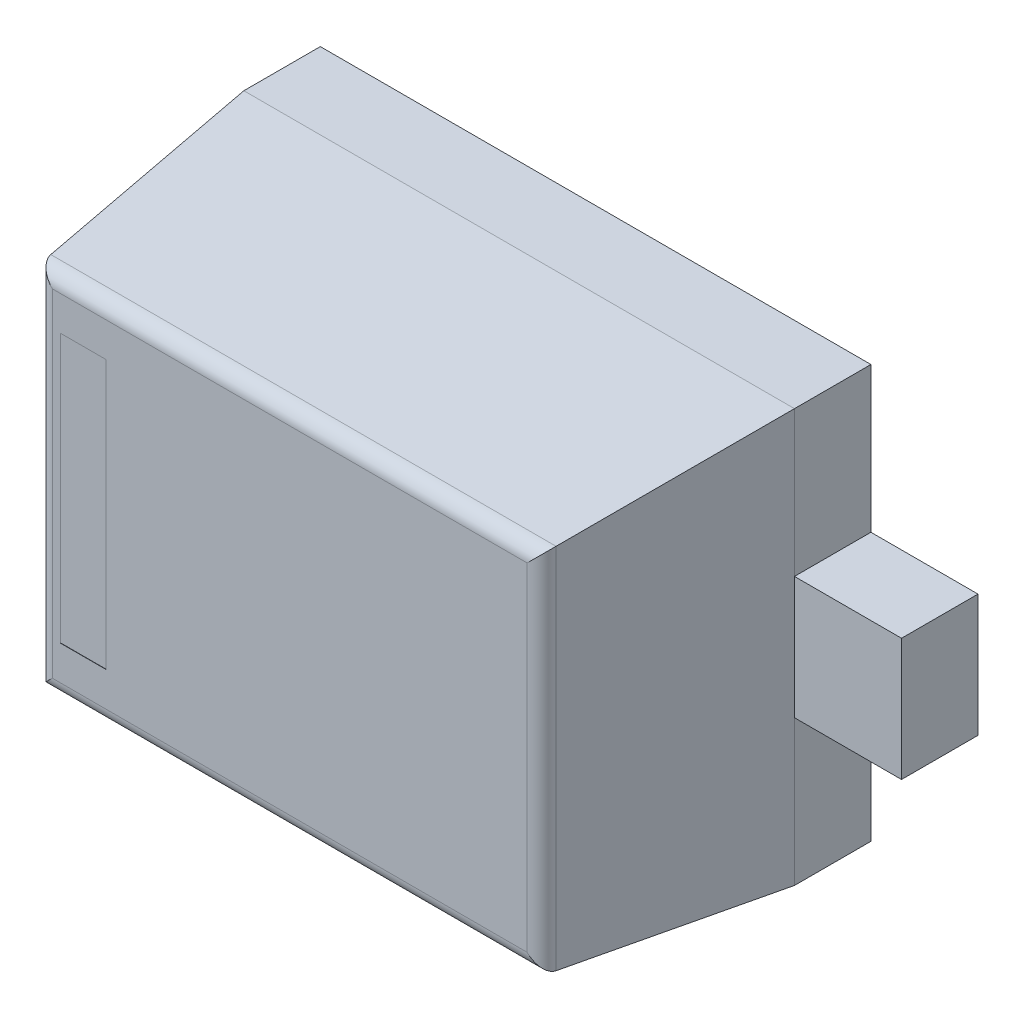
ISO-10303-21;
HEADER;
FILE_DESCRIPTION(('STEP AP214'),'2;1');
FILE_NAME('part.step','',(''),(''),'','','');
FILE_SCHEMA(('AUTOMOTIVE_DESIGN { 1 0 10303 214 1 1 1 1 }'));
ENDSEC;
DATA;
#1=APPLICATION_CONTEXT('core data for automotive mechanical design processes');
#2=APPLICATION_PROTOCOL_DEFINITION('international standard','automotive_design',2000,#1);
#3=PRODUCT_CONTEXT('',#1,'mechanical');
#4=PRODUCT('Part','Part','',(#3));
#5=PRODUCT_RELATED_PRODUCT_CATEGORY('part','',(#4));
#6=PRODUCT_DEFINITION_FORMATION('','',#4);
#7=PRODUCT_DEFINITION_CONTEXT('part definition',#1,'design');
#8=PRODUCT_DEFINITION('design','',#6,#7);
#9=PRODUCT_DEFINITION_SHAPE('','',#8);
#10=(LENGTH_UNIT() NAMED_UNIT(*) SI_UNIT(.MILLI.,.METRE.));
#11=(NAMED_UNIT(*) PLANE_ANGLE_UNIT() SI_UNIT($,.RADIAN.));
#12=(NAMED_UNIT(*) SI_UNIT($,.STERADIAN.) SOLID_ANGLE_UNIT());
#13=UNCERTAINTY_MEASURE_WITH_UNIT(LENGTH_MEASURE(1.E-05),#10,'distance_accuracy_value','');
#14=(GEOMETRIC_REPRESENTATION_CONTEXT(3) GLOBAL_UNCERTAINTY_ASSIGNED_CONTEXT((#13)) GLOBAL_UNIT_ASSIGNED_CONTEXT((#10,
#11,#12)) REPRESENTATION_CONTEXT('',''));
#15=CARTESIAN_POINT('',(0.,0.,0.));
#16=DIRECTION('',(0.,0.,1.));
#17=DIRECTION('',(1.,0.,0.));
#18=AXIS2_PLACEMENT_3D('',#15,#16,#17);
#19=CARTESIAN_POINT('',(-0.9,0.675,1.));
#20=DIRECTION('',(1.,0.,0.));
#21=DIRECTION('',(0.,1.,0.));
#22=AXIS2_PLACEMENT_3D('',#19,#20,#21);
#23=PLANE('',#22);
#24=DIRECTION('',(0.,0.,-1.));
#25=VECTOR('',#24,1.);
#26=CARTESIAN_POINT('',(-0.9,0.2,0.25));
#27=LINE('',#26,#25);
#28=CARTESIAN_POINT('',(-0.9,0.2,0.25));
#29=VERTEX_POINT('',#28);
#30=CARTESIAN_POINT('',(-0.9,0.2,0.));
#31=VERTEX_POINT('',#30);
#32=EDGE_CURVE('E197',#29,#31,#27,.T.);
#33=ORIENTED_EDGE('',*,*,#32,.F.);
#34=DIRECTION('',(0.,1.,0.));
#35=VECTOR('',#34,1.);
#36=CARTESIAN_POINT('',(-0.9,0.675,0.249999999999975));
#37=LINE('',#36,#35);
#38=CARTESIAN_POINT('',(-0.9,0.675,0.249999999999975));
#39=VERTEX_POINT('',#38);
#40=EDGE_CURVE('E235',#29,#39,#37,.T.);
#41=ORIENTED_EDGE('',*,*,#40,.T.);
#42=DIRECTION('',(0.,0.,-1.));
#43=VECTOR('',#42,1.);
#44=CARTESIAN_POINT('',(-0.9,0.675,1.));
#45=LINE('',#44,#43);
#46=CARTESIAN_POINT('',(-0.9,0.675,0.));
#47=VERTEX_POINT('',#46);
#48=EDGE_CURVE('E375',#39,#47,#45,.T.);
#49=ORIENTED_EDGE('',*,*,#48,.T.);
#50=DIRECTION('',(0.,-1.,0.));
#51=VECTOR('',#50,1.);
#52=CARTESIAN_POINT('',(-0.9,0.675,0.));
#53=LINE('',#52,#51);
#54=EDGE_CURVE('E385',#47,#31,#53,.T.);
#55=ORIENTED_EDGE('',*,*,#54,.T.);
#56=EDGE_LOOP('',(#33,#41,#49,#55));
#57=FACE_BOUND('',#56,.T.);
#58=ADVANCED_FACE('F32',(#57),#23,.F.);
#59=CARTESIAN_POINT('',(0.9,0.675,1.));
#60=DIRECTION('',(-1.,0.,0.));
#61=DIRECTION('',(0.,-1.,0.));
#62=AXIS2_PLACEMENT_3D('',#59,#60,#61);
#63=PLANE('',#62);
#64=DIRECTION('',(0.,0.,-1.));
#65=VECTOR('',#64,1.);
#66=CARTESIAN_POINT('',(0.9,-0.2,0.25));
#67=LINE('',#66,#65);
#68=CARTESIAN_POINT('',(0.9,-0.2,0.25));
#69=VERTEX_POINT('',#68);
#70=CARTESIAN_POINT('',(0.9,-0.2,0.));
#71=VERTEX_POINT('',#70);
#72=EDGE_CURVE('E211',#69,#71,#67,.T.);
#73=ORIENTED_EDGE('',*,*,#72,.F.);
#74=DIRECTION('',(0.,-1.,0.));
#75=VECTOR('',#74,1.);
#76=CARTESIAN_POINT('',(0.9,-0.675,0.249999999999975));
#77=LINE('',#76,#75);
#78=CARTESIAN_POINT('',(0.9,-0.675,0.249999999999975));
#79=VERTEX_POINT('',#78);
#80=EDGE_CURVE('E244',#69,#79,#77,.T.);
#81=ORIENTED_EDGE('',*,*,#80,.T.);
#82=DIRECTION('',(0.,0.,-1.));
#83=VECTOR('',#82,1.);
#84=CARTESIAN_POINT('',(0.9,-0.675,1.));
#85=LINE('',#84,#83);
#86=CARTESIAN_POINT('',(0.9,-0.675,0.));
#87=VERTEX_POINT('',#86);
#88=EDGE_CURVE('E372',#79,#87,#85,.T.);
#89=ORIENTED_EDGE('',*,*,#88,.T.);
#90=DIRECTION('',(0.,1.,0.));
#91=VECTOR('',#90,1.);
#92=CARTESIAN_POINT('',(0.9,0.675,0.));
#93=LINE('',#92,#91);
#94=EDGE_CURVE('E395',#87,#71,#93,.T.);
#95=ORIENTED_EDGE('',*,*,#94,.T.);
#96=EDGE_LOOP('',(#73,#81,#89,#95));
#97=FACE_BOUND('',#96,.T.);
#98=ADVANCED_FACE('F342',(#97),#63,.F.);
#99=CARTESIAN_POINT('',(0.9,0.675,0.249999999999975));
#100=VERTEX_POINT('',#99);
#101=CARTESIAN_POINT('',(0.9,0.2,0.25));
#102=VERTEX_POINT('',#101);
#103=EDGE_CURVE('E253',#100,#102,#77,.T.);
#104=ORIENTED_EDGE('',*,*,#103,.T.);
#105=DIRECTION('',(0.,0.,-1.));
#106=VECTOR('',#105,1.);
#107=CARTESIAN_POINT('',(0.9,0.2,0.25));
#108=LINE('',#107,#106);
#109=CARTESIAN_POINT('',(0.9,0.2,0.));
#110=VERTEX_POINT('',#109);
#111=EDGE_CURVE('E220',#102,#110,#108,.T.);
#112=ORIENTED_EDGE('',*,*,#111,.T.);
#113=CARTESIAN_POINT('',(0.9,0.675,0.));
#114=VERTEX_POINT('',#113);
#115=EDGE_CURVE('E285',#110,#114,#93,.T.);
#116=ORIENTED_EDGE('',*,*,#115,.T.);
#117=DIRECTION('',(0.,0.,-1.));
#118=VECTOR('',#117,1.);
#119=CARTESIAN_POINT('',(0.9,0.675,1.));
#120=LINE('',#119,#118);
#121=EDGE_CURVE('E373',#100,#114,#120,.T.);
#122=ORIENTED_EDGE('',*,*,#121,.F.);
#123=EDGE_LOOP('',(#104,#112,#116,#122));
#124=FACE_BOUND('',#123,.T.);
#125=ADVANCED_FACE('F349',(#124),#63,.F.);
#126=CARTESIAN_POINT('',(-0.9,0.675,1.));
#127=DIRECTION('',(0.,-1.,0.));
#128=DIRECTION('',(0.,0.,-1.));
#129=AXIS2_PLACEMENT_3D('',#126,#127,#128);
#130=PLANE('',#129);
#131=ORIENTED_EDGE('',*,*,#48,.F.);
#132=DIRECTION('',(1.,0.,0.));
#133=VECTOR('',#132,1.);
#134=CARTESIAN_POINT('',(0.9,0.675,0.249999999999975));
#135=LINE('',#134,#133);
#136=EDGE_CURVE('E234',#39,#100,#135,.T.);
#137=ORIENTED_EDGE('',*,*,#136,.T.);
#138=ORIENTED_EDGE('',*,*,#121,.T.);
#139=DIRECTION('',(-1.,0.,0.));
#140=VECTOR('',#139,1.);
#141=CARTESIAN_POINT('',(-0.9,0.675,0.));
#142=LINE('',#141,#140);
#143=EDGE_CURVE('E388',#114,#47,#142,.T.);
#144=ORIENTED_EDGE('',*,*,#143,.T.);
#145=EDGE_LOOP('',(#131,#137,#138,#144));
#146=FACE_BOUND('',#145,.T.);
#147=ADVANCED_FACE('F357',(#146),#130,.F.);
#148=CARTESIAN_POINT('',(-0.9,-0.675,0.249999999999975));
#149=VERTEX_POINT('',#148);
#150=CARTESIAN_POINT('',(-0.9,-0.2,0.25));
#151=VERTEX_POINT('',#150);
#152=EDGE_CURVE('E230',#149,#151,#37,.T.);
#153=ORIENTED_EDGE('',*,*,#152,.T.);
#154=DIRECTION('',(0.,0.,-1.));
#155=VECTOR('',#154,1.);
#156=CARTESIAN_POINT('',(-0.9,-0.2,0.25));
#157=LINE('',#156,#155);
#158=CARTESIAN_POINT('',(-0.9,-0.2,0.));
#159=VERTEX_POINT('',#158);
#160=EDGE_CURVE('E175',#151,#159,#157,.T.);
#161=ORIENTED_EDGE('',*,*,#160,.T.);
#162=CARTESIAN_POINT('',(-0.9,-0.675,0.));
#163=VERTEX_POINT('',#162);
#164=EDGE_CURVE('E392',#159,#163,#53,.T.);
#165=ORIENTED_EDGE('',*,*,#164,.T.);
#166=DIRECTION('',(0.,0.,-1.));
#167=VECTOR('',#166,1.);
#168=CARTESIAN_POINT('',(-0.9,-0.675,1.));
#169=LINE('',#168,#167);
#170=EDGE_CURVE('E368',#149,#163,#169,.T.);
#171=ORIENTED_EDGE('',*,*,#170,.F.);
#172=EDGE_LOOP('',(#153,#161,#165,#171));
#173=FACE_BOUND('',#172,.T.);
#174=ADVANCED_FACE('F345',(#173),#23,.F.);
#175=CARTESIAN_POINT('',(-0.9,-0.675,1.));
#176=DIRECTION('',(0.,1.,0.));
#177=DIRECTION('',(0.,0.,1.));
#178=AXIS2_PLACEMENT_3D('',#175,#176,#177);
#179=PLANE('',#178);
#180=ORIENTED_EDGE('',*,*,#88,.F.);
#181=DIRECTION('',(-1.,0.,0.));
#182=VECTOR('',#181,1.);
#183=CARTESIAN_POINT('',(-0.9,-0.675,0.249999999999975));
#184=LINE('',#183,#182);
#185=EDGE_CURVE('E240',#79,#149,#184,.T.);
#186=ORIENTED_EDGE('',*,*,#185,.T.);
#187=ORIENTED_EDGE('',*,*,#170,.T.);
#188=DIRECTION('',(1.,0.,0.));
#189=VECTOR('',#188,1.);
#190=CARTESIAN_POINT('',(-0.9,-0.675,0.));
#191=LINE('',#190,#189);
#192=EDGE_CURVE('E383',#163,#87,#191,.T.);
#193=ORIENTED_EDGE('',*,*,#192,.T.);
#194=EDGE_LOOP('',(#180,#186,#187,#193));
#195=FACE_BOUND('',#194,.T.);
#196=ADVANCED_FACE('F356',(#195),#179,.F.);
#197=CARTESIAN_POINT('',(0.,0.,1.));
#198=DIRECTION('',(0.,0.,1.));
#199=DIRECTION('',(1.,0.,0.));
#200=AXIS2_PLACEMENT_3D('',#197,#198,#199);
#201=PLANE('',#200);
#202=DIRECTION('',(0.,1.,0.));
#203=VECTOR('',#202,1.);
#204=CARTESIAN_POINT('',(-0.6,0.43875,1.));
#205=LINE('',#204,#203);
#206=CARTESIAN_POINT('',(-0.6,-0.43875,1.));
#207=VERTEX_POINT('',#206);
#208=CARTESIAN_POINT('',(-0.6,0.43875,1.));
#209=VERTEX_POINT('',#208);
#210=EDGE_CURVE('E423',#207,#209,#205,.T.);
#211=ORIENTED_EDGE('',*,*,#210,.F.);
#212=DIRECTION('',(1.,0.,0.));
#213=VECTOR('',#212,1.);
#214=CARTESIAN_POINT('',(-0.75,-0.43875,1.));
#215=LINE('',#214,#213);
#216=CARTESIAN_POINT('',(-0.75,-0.43875,1.));
#217=VERTEX_POINT('',#216);
#218=EDGE_CURVE('E413',#217,#207,#215,.T.);
#219=ORIENTED_EDGE('',*,*,#218,.F.);
#220=DIRECTION('',(0.,-1.,0.));
#221=VECTOR('',#220,1.);
#222=CARTESIAN_POINT('',(-0.75,0.43875,1.));
#223=LINE('',#222,#221);
#224=CARTESIAN_POINT('',(-0.75,0.43875,1.));
#225=VERTEX_POINT('',#224);
#226=EDGE_CURVE('E417',#225,#217,#223,.T.);
#227=ORIENTED_EDGE('',*,*,#226,.F.);
#228=DIRECTION('',(-1.,0.,0.));
#229=VECTOR('',#228,1.);
#230=CARTESIAN_POINT('',(-0.75,0.43875,1.));
#231=LINE('',#230,#229);
#232=EDGE_CURVE('E420',#209,#225,#231,.T.);
#233=ORIENTED_EDGE('',*,*,#232,.F.);
#234=EDGE_LOOP('',(#211,#219,#227,#233));
#235=FACE_BOUND('',#234,.T.);
#236=DIRECTION('',(0.,1.,0.));
#237=VECTOR('',#236,1.);
#238=CARTESIAN_POINT('',(0.776151621335851,0.,1.));
#239=LINE('',#238,#237);
#240=CARTESIAN_POINT('',(0.776151621335851,-0.551151621335851,1.));
#241=VERTEX_POINT('',#240);
#242=CARTESIAN_POINT('',(0.776151621335851,0.551151621335851,1.));
#243=VERTEX_POINT('',#242);
#244=EDGE_CURVE('E277',#241,#243,#239,.T.);
#245=ORIENTED_EDGE('',*,*,#244,.T.);
#246=DIRECTION('',(-1.,0.,0.));
#247=VECTOR('',#246,1.);
#248=CARTESIAN_POINT('',(0.,0.551151621335851,1.));
#249=LINE('',#248,#247);
#250=CARTESIAN_POINT('',(-0.77615162133585,0.551151621335851,1.));
#251=VERTEX_POINT('',#250);
#252=EDGE_CURVE('E274',#243,#251,#249,.T.);
#253=ORIENTED_EDGE('',*,*,#252,.T.);
#254=DIRECTION('',(0.,-1.,0.));
#255=VECTOR('',#254,1.);
#256=CARTESIAN_POINT('',(-0.77615162133585,0.,1.));
#257=LINE('',#256,#255);
#258=CARTESIAN_POINT('',(-0.77615162133585,-0.551151621335851,1.));
#259=VERTEX_POINT('',#258);
#260=EDGE_CURVE('E256',#251,#259,#257,.T.);
#261=ORIENTED_EDGE('',*,*,#260,.T.);
#262=DIRECTION('',(1.,0.,0.));
#263=VECTOR('',#262,1.);
#264=CARTESIAN_POINT('',(0.,-0.551151621335851,1.));
#265=LINE('',#264,#263);
#266=EDGE_CURVE('E279',#259,#241,#265,.T.);
#267=ORIENTED_EDGE('',*,*,#266,.T.);
#268=EDGE_LOOP('',(#245,#253,#261,#267));
#269=FACE_BOUND('',#268,.T.);
#270=ADVANCED_FACE('F312',(#235,#269),#201,.T.);
#271=CARTESIAN_POINT('',(0.,0.,0.));
#272=DIRECTION('',(0.,0.,1.));
#273=DIRECTION('',(1.,0.,0.));
#274=AXIS2_PLACEMENT_3D('',#271,#272,#273);
#275=PLANE('',#274);
#276=ORIENTED_EDGE('',*,*,#94,.F.);
#277=ORIENTED_EDGE('',*,*,#192,.F.);
#278=ORIENTED_EDGE('',*,*,#164,.F.);
#279=DIRECTION('',(1.,0.,0.));
#280=VECTOR('',#279,1.);
#281=CARTESIAN_POINT('',(-0.9,-0.2,0.));
#282=LINE('',#281,#280);
#283=CARTESIAN_POINT('',(-1.25,-0.2,0.));
#284=VERTEX_POINT('',#283);
#285=EDGE_CURVE('E49',#284,#159,#282,.T.);
#286=ORIENTED_EDGE('',*,*,#285,.F.);
#287=DIRECTION('',(0.,-1.,0.));
#288=VECTOR('',#287,1.);
#289=CARTESIAN_POINT('',(-1.25,0.2,0.));
#290=LINE('',#289,#288);
#291=CARTESIAN_POINT('',(-1.25,0.2,0.));
#292=VERTEX_POINT('',#291);
#293=EDGE_CURVE('E192',#292,#284,#290,.T.);
#294=ORIENTED_EDGE('',*,*,#293,.F.);
#295=DIRECTION('',(-1.,0.,0.));
#296=VECTOR('',#295,1.);
#297=CARTESIAN_POINT('',(-0.9,0.2,0.));
#298=LINE('',#297,#296);
#299=EDGE_CURVE('E188',#31,#292,#298,.T.);
#300=ORIENTED_EDGE('',*,*,#299,.F.);
#301=ORIENTED_EDGE('',*,*,#54,.F.);
#302=ORIENTED_EDGE('',*,*,#143,.F.);
#303=ORIENTED_EDGE('',*,*,#115,.F.);
#304=DIRECTION('',(-1.,0.,0.));
#305=VECTOR('',#304,1.);
#306=CARTESIAN_POINT('',(0.9,0.2,0.));
#307=LINE('',#306,#305);
#308=CARTESIAN_POINT('',(1.25,0.2,0.));
#309=VERTEX_POINT('',#308);
#310=EDGE_CURVE('E57',#309,#110,#307,.T.);
#311=ORIENTED_EDGE('',*,*,#310,.F.);
#312=DIRECTION('',(0.,1.,0.));
#313=VECTOR('',#312,1.);
#314=CARTESIAN_POINT('',(1.25,-0.2,0.));
#315=LINE('',#314,#313);
#316=CARTESIAN_POINT('',(1.25,-0.2,0.));
#317=VERTEX_POINT('',#316);
#318=EDGE_CURVE('E193',#317,#309,#315,.T.);
#319=ORIENTED_EDGE('',*,*,#318,.F.);
#320=DIRECTION('',(1.,0.,0.));
#321=VECTOR('',#320,1.);
#322=CARTESIAN_POINT('',(0.9,-0.2,0.));
#323=LINE('',#322,#321);
#324=EDGE_CURVE('E206',#71,#317,#323,.T.);
#325=ORIENTED_EDGE('',*,*,#324,.F.);
#326=EDGE_LOOP('',(#276,#277,#278,#286,#294,#300,#301,#302,#303,#311,#319,#325));
#327=FACE_BOUND('',#326,.T.);
#328=ADVANCED_FACE('F464',(#327),#275,.F.);
#329=CARTESIAN_POINT('',(0.,0.596171823550743,1.));
#330=DIRECTION('',(0.,0.994521895368274,0.10452846326765));
#331=DIRECTION('',(1.,0.,0.));
#332=AXIS2_PLACEMENT_3D('',#329,#330,#331);
#333=PLANE('',#332);
#334=DIRECTION('',(0.103962051184494,-0.103962051184494,0.989132844377855));
#335=VECTOR('',#334,1.);
#336=CARTESIAN_POINT('',(-0.812296509724228,0.587296509724228,1.08444297039106));
#337=LINE('',#336,#335);
#338=CARTESIAN_POINT('',(-0.825877716104264,0.600877716104264,0.955226423163382));
#339=VERTEX_POINT('',#338);
#340=EDGE_CURVE('E282',#339,#39,#337,.F.);
#341=ORIENTED_EDGE('',*,*,#340,.F.);
#342=DIRECTION('',(-1.,0.,0.));
#343=VECTOR('',#342,1.);
#344=CARTESIAN_POINT('',(0.,0.600877716104264,0.955226423163382));
#345=LINE('',#344,#343);
#346=CARTESIAN_POINT('',(0.825877716104264,0.600877716104264,0.955226423163383));
#347=VERTEX_POINT('',#346);
#348=EDGE_CURVE('E271',#339,#347,#345,.F.);
#349=ORIENTED_EDGE('',*,*,#348,.T.);
#350=DIRECTION('',(-0.103962051184494,-0.103962051184494,0.989132844377855));
#351=VECTOR('',#350,1.);
#352=CARTESIAN_POINT('',(0.814728334043688,0.589728334043688,1.06130570752708));
#353=LINE('',#352,#351);
#354=EDGE_CURVE('E286',#100,#347,#353,.T.);
#355=ORIENTED_EDGE('',*,*,#354,.F.);
#356=ORIENTED_EDGE('',*,*,#136,.F.);
#357=EDGE_LOOP('',(#341,#349,#355,#356));
#358=FACE_BOUND('',#357,.T.);
#359=ADVANCED_FACE('F325',(#358),#333,.T.);
#360=CARTESIAN_POINT('',(-0.821171823550742,0.,1.));
#361=DIRECTION('',(-0.994521895368274,0.,0.10452846326765));
#362=DIRECTION('',(0.,1.,0.));
#363=AXIS2_PLACEMENT_3D('',#360,#361,#362);
#364=PLANE('',#363);
#365=DIRECTION('',(0.103962051184494,0.103962051184494,0.989132844377855));
#366=VECTOR('',#365,1.);
#367=CARTESIAN_POINT('',(-0.814728334043688,-0.589728334043688,1.06130570752708));
#368=LINE('',#367,#366);
#369=CARTESIAN_POINT('',(-0.825877716104264,-0.600877716104264,0.955226423163383));
#370=VERTEX_POINT('',#369);
#371=EDGE_CURVE('E288',#370,#149,#368,.F.);
#372=ORIENTED_EDGE('',*,*,#371,.F.);
#373=DIRECTION('',(0.,-1.,0.));
#374=VECTOR('',#373,1.);
#375=CARTESIAN_POINT('',(-0.825877716104264,0.,0.955226423163382));
#376=LINE('',#375,#374);
#377=EDGE_CURVE('E11',#370,#339,#376,.F.);
#378=ORIENTED_EDGE('',*,*,#377,.T.);
#379=ORIENTED_EDGE('',*,*,#340,.T.);
#380=ORIENTED_EDGE('',*,*,#40,.F.);
#381=DIRECTION('',(0.,1.,0.));
#382=VECTOR('',#381,1.);
#383=CARTESIAN_POINT('',(-0.9,0.2,0.25));
#384=LINE('',#383,#382);
#385=EDGE_CURVE('E178',#151,#29,#384,.T.);
#386=ORIENTED_EDGE('',*,*,#385,.F.);
#387=ORIENTED_EDGE('',*,*,#152,.F.);
#388=EDGE_LOOP('',(#372,#378,#379,#380,#386,#387));
#389=FACE_BOUND('',#388,.T.);
#390=ADVANCED_FACE('F319',(#389),#364,.T.);
#391=CARTESIAN_POINT('',(0.821171823550743,0.,1.));
#392=DIRECTION('',(0.994521895368274,0.,0.10452846326765));
#393=DIRECTION('',(0.,-1.,0.));
#394=AXIS2_PLACEMENT_3D('',#391,#392,#393);
#395=PLANE('',#394);
#396=ORIENTED_EDGE('',*,*,#354,.T.);
#397=DIRECTION('',(0.,1.,0.));
#398=VECTOR('',#397,1.);
#399=CARTESIAN_POINT('',(0.825877716104264,0.,0.955226423163382));
#400=LINE('',#399,#398);
#401=CARTESIAN_POINT('',(0.825877716104264,-0.600877716104264,0.955226423163383));
#402=VERTEX_POINT('',#401);
#403=EDGE_CURVE('E269',#347,#402,#400,.F.);
#404=ORIENTED_EDGE('',*,*,#403,.T.);
#405=DIRECTION('',(0.103962051184494,-0.103962051184494,-0.989132844377855));
#406=VECTOR('',#405,1.);
#407=CARTESIAN_POINT('',(0.814728334043688,-0.589728334043688,1.06130570752708));
#408=LINE('',#407,#406);
#409=EDGE_CURVE('E247',#79,#402,#408,.F.);
#410=ORIENTED_EDGE('',*,*,#409,.F.);
#411=ORIENTED_EDGE('',*,*,#80,.F.);
#412=DIRECTION('',(0.,-1.,0.));
#413=VECTOR('',#412,1.);
#414=CARTESIAN_POINT('',(0.9,-0.2,0.25));
#415=LINE('',#414,#413);
#416=EDGE_CURVE('E224',#102,#69,#415,.T.);
#417=ORIENTED_EDGE('',*,*,#416,.F.);
#418=ORIENTED_EDGE('',*,*,#103,.F.);
#419=EDGE_LOOP('',(#396,#404,#410,#411,#417,#418));
#420=FACE_BOUND('',#419,.T.);
#421=ADVANCED_FACE('F454',(#420),#395,.T.);
#422=CARTESIAN_POINT('',(0.,-0.596171823550743,1.));
#423=DIRECTION('',(0.,-0.994521895368274,0.10452846326765));
#424=DIRECTION('',(-1.,0.,0.));
#425=AXIS2_PLACEMENT_3D('',#422,#423,#424);
#426=PLANE('',#425);
#427=ORIENTED_EDGE('',*,*,#409,.T.);
#428=DIRECTION('',(1.,0.,0.));
#429=VECTOR('',#428,1.);
#430=CARTESIAN_POINT('',(0.,-0.600877716104264,0.955226423163382));
#431=LINE('',#430,#429);
#432=EDGE_CURVE('E41',#402,#370,#431,.F.);
#433=ORIENTED_EDGE('',*,*,#432,.T.);
#434=ORIENTED_EDGE('',*,*,#371,.T.);
#435=ORIENTED_EDGE('',*,*,#185,.F.);
#436=EDGE_LOOP('',(#427,#433,#434,#435));
#437=FACE_BOUND('',#436,.T.);
#438=ADVANCED_FACE('F296',(#437),#426,.T.);
#439=CARTESIAN_POINT('',(0.,-0.551151621335851,0.95));
#440=DIRECTION('',(1.,0.,0.));
#441=DIRECTION('',(0.,0.,-1.));
#442=AXIS2_PLACEMENT_3D('',#439,#440,#441);
#443=CYLINDRICAL_SURFACE('',#442,0.05);
#444=CARTESIAN_POINT('',(-0.77615162133585,-0.551151621335851,0.95));
#445=DIRECTION('',(0.707106781186548,-0.707106781186547,0.));
#446=DIRECTION('',(-0.707106781186547,-0.707106781186548,0.));
#447=AXIS2_PLACEMENT_3D('',#444,#445,#446);
#448=ELLIPSE('',#447,0.0707106781186548,0.05);
#449=EDGE_CURVE('E260',#370,#259,#448,.F.);
#450=ORIENTED_EDGE('',*,*,#449,.F.);
#451=ORIENTED_EDGE('',*,*,#432,.F.);
#452=CARTESIAN_POINT('',(0.776151621335851,-0.551151621335851,0.95));
#453=DIRECTION('',(0.707106781186547,0.707106781186548,0.));
#454=DIRECTION('',(0.707106781186547,-0.707106781186547,0.));
#455=AXIS2_PLACEMENT_3D('',#452,#453,#454);
#456=ELLIPSE('',#455,0.0707106781186548,0.05);
#457=EDGE_CURVE('E257',#241,#402,#456,.T.);
#458=ORIENTED_EDGE('',*,*,#457,.F.);
#459=ORIENTED_EDGE('',*,*,#266,.F.);
#460=EDGE_LOOP('',(#450,#451,#458,#459));
#461=FACE_BOUND('',#460,.T.);
#462=ADVANCED_FACE('F34',(#461),#443,.T.);
#463=CARTESIAN_POINT('',(0.776151621335851,0.,0.95));
#464=DIRECTION('',(0.,1.,0.));
#465=DIRECTION('',(-1.,0.,0.));
#466=AXIS2_PLACEMENT_3D('',#463,#464,#465);
#467=CYLINDRICAL_SURFACE('',#466,0.05);
#468=ORIENTED_EDGE('',*,*,#457,.T.);
#469=ORIENTED_EDGE('',*,*,#403,.F.);
#470=CARTESIAN_POINT('',(0.776151621335851,0.551151621335851,0.95));
#471=DIRECTION('',(-0.707106781186547,0.707106781186547,0.));
#472=DIRECTION('',(0.707106781186547,0.707106781186548,0.));
#473=AXIS2_PLACEMENT_3D('',#470,#471,#472);
#474=ELLIPSE('',#473,0.0707106781186548,0.05);
#475=EDGE_CURVE('E263',#243,#347,#474,.T.);
#476=ORIENTED_EDGE('',*,*,#475,.F.);
#477=ORIENTED_EDGE('',*,*,#244,.F.);
#478=EDGE_LOOP('',(#468,#469,#476,#477));
#479=FACE_BOUND('',#478,.T.);
#480=ADVANCED_FACE('F308',(#479),#467,.T.);
#481=CARTESIAN_POINT('',(-0.77615162133585,0.,0.95));
#482=DIRECTION('',(0.,-1.,0.));
#483=DIRECTION('',(1.,0.,0.));
#484=AXIS2_PLACEMENT_3D('',#481,#482,#483);
#485=CYLINDRICAL_SURFACE('',#484,0.05);
#486=ORIENTED_EDGE('',*,*,#449,.T.);
#487=ORIENTED_EDGE('',*,*,#260,.F.);
#488=CARTESIAN_POINT('',(-0.77615162133585,0.551151621335851,0.95));
#489=DIRECTION('',(-0.707106781186547,-0.707106781186548,0.));
#490=DIRECTION('',(0.707106781186548,-0.707106781186547,0.));
#491=AXIS2_PLACEMENT_3D('',#488,#489,#490);
#492=ELLIPSE('',#491,0.0707106781186548,0.05);
#493=EDGE_CURVE('E265',#339,#251,#492,.F.);
#494=ORIENTED_EDGE('',*,*,#493,.F.);
#495=ORIENTED_EDGE('',*,*,#377,.F.);
#496=EDGE_LOOP('',(#486,#487,#494,#495));
#497=FACE_BOUND('',#496,.T.);
#498=ADVANCED_FACE('F315',(#497),#485,.T.);
#499=CARTESIAN_POINT('',(0.,0.551151621335851,0.95));
#500=DIRECTION('',(-1.,0.,0.));
#501=DIRECTION('',(0.,0.,1.));
#502=AXIS2_PLACEMENT_3D('',#499,#500,#501);
#503=CYLINDRICAL_SURFACE('',#502,0.05);
#504=ORIENTED_EDGE('',*,*,#475,.T.);
#505=ORIENTED_EDGE('',*,*,#348,.F.);
#506=ORIENTED_EDGE('',*,*,#493,.T.);
#507=ORIENTED_EDGE('',*,*,#252,.F.);
#508=EDGE_LOOP('',(#504,#505,#506,#507));
#509=FACE_BOUND('',#508,.T.);
#510=ADVANCED_FACE('F328',(#509),#503,.T.);
#511=CARTESIAN_POINT('',(-0.6,0.43875,0.999));
#512=DIRECTION('',(1.,0.,0.));
#513=DIRECTION('',(0.,0.,-1.));
#514=AXIS2_PLACEMENT_3D('',#511,#512,#513);
#515=PLANE('',#514);
#516=ORIENTED_EDGE('',*,*,#210,.T.);
#517=DIRECTION('',(0.,0.,1.));
#518=VECTOR('',#517,1.);
#519=CARTESIAN_POINT('',(-0.6,0.43875,0.999));
#520=LINE('',#519,#518);
#521=CARTESIAN_POINT('',(-0.6,0.43875,0.999));
#522=VERTEX_POINT('',#521);
#523=EDGE_CURVE('E403',#522,#209,#520,.T.);
#524=ORIENTED_EDGE('',*,*,#523,.F.);
#525=DIRECTION('',(0.,1.,0.));
#526=VECTOR('',#525,1.);
#527=CARTESIAN_POINT('',(-0.6,0.43875,0.999));
#528=LINE('',#527,#526);
#529=CARTESIAN_POINT('',(-0.6,-0.43875,0.999));
#530=VERTEX_POINT('',#529);
#531=EDGE_CURVE('E416',#530,#522,#528,.T.);
#532=ORIENTED_EDGE('',*,*,#531,.F.);
#533=DIRECTION('',(0.,0.,1.));
#534=VECTOR('',#533,1.);
#535=CARTESIAN_POINT('',(-0.6,-0.43875,0.999));
#536=LINE('',#535,#534);
#537=EDGE_CURVE('E266',#530,#207,#536,.T.);
#538=ORIENTED_EDGE('',*,*,#537,.T.);
#539=EDGE_LOOP('',(#516,#524,#532,#538));
#540=FACE_BOUND('',#539,.T.);
#541=ADVANCED_FACE('F330',(#540),#515,.F.);
#542=CARTESIAN_POINT('',(-0.75,-0.43875,0.999));
#543=DIRECTION('',(0.,-1.,0.));
#544=DIRECTION('',(0.,0.,-1.));
#545=AXIS2_PLACEMENT_3D('',#542,#543,#544);
#546=PLANE('',#545);
#547=ORIENTED_EDGE('',*,*,#218,.T.);
#548=ORIENTED_EDGE('',*,*,#537,.F.);
#549=DIRECTION('',(1.,0.,0.));
#550=VECTOR('',#549,1.);
#551=CARTESIAN_POINT('',(-0.75,-0.43875,0.999));
#552=LINE('',#551,#550);
#553=CARTESIAN_POINT('',(-0.75,-0.43875,0.999));
#554=VERTEX_POINT('',#553);
#555=EDGE_CURVE('E408',#554,#530,#552,.T.);
#556=ORIENTED_EDGE('',*,*,#555,.F.);
#557=DIRECTION('',(0.,0.,1.));
#558=VECTOR('',#557,1.);
#559=CARTESIAN_POINT('',(-0.75,-0.43875,0.999));
#560=LINE('',#559,#558);
#561=EDGE_CURVE('E410',#554,#217,#560,.T.);
#562=ORIENTED_EDGE('',*,*,#561,.T.);
#563=EDGE_LOOP('',(#547,#548,#556,#562));
#564=FACE_BOUND('',#563,.T.);
#565=ADVANCED_FACE('F336',(#564),#546,.F.);
#566=CARTESIAN_POINT('',(-0.75,0.43875,0.999));
#567=DIRECTION('',(-1.,0.,0.));
#568=DIRECTION('',(0.,-1.,0.));
#569=AXIS2_PLACEMENT_3D('',#566,#567,#568);
#570=PLANE('',#569);
#571=ORIENTED_EDGE('',*,*,#226,.T.);
#572=ORIENTED_EDGE('',*,*,#561,.F.);
#573=DIRECTION('',(0.,-1.,0.));
#574=VECTOR('',#573,1.);
#575=CARTESIAN_POINT('',(-0.75,0.43875,0.999));
#576=LINE('',#575,#574);
#577=CARTESIAN_POINT('',(-0.75,0.43875,0.999));
#578=VERTEX_POINT('',#577);
#579=EDGE_CURVE('E428',#578,#554,#576,.T.);
#580=ORIENTED_EDGE('',*,*,#579,.F.);
#581=DIRECTION('',(0.,0.,1.));
#582=VECTOR('',#581,1.);
#583=CARTESIAN_POINT('',(-0.75,0.43875,0.999));
#584=LINE('',#583,#582);
#585=EDGE_CURVE('E407',#578,#225,#584,.T.);
#586=ORIENTED_EDGE('',*,*,#585,.T.);
#587=EDGE_LOOP('',(#571,#572,#580,#586));
#588=FACE_BOUND('',#587,.T.);
#589=ADVANCED_FACE('F480',(#588),#570,.F.);
#590=CARTESIAN_POINT('',(-0.75,0.43875,0.999));
#591=DIRECTION('',(0.,1.,0.));
#592=DIRECTION('',(-1.,0.,0.));
#593=AXIS2_PLACEMENT_3D('',#590,#591,#592);
#594=PLANE('',#593);
#595=ORIENTED_EDGE('',*,*,#232,.T.);
#596=ORIENTED_EDGE('',*,*,#585,.F.);
#597=DIRECTION('',(-1.,0.,0.));
#598=VECTOR('',#597,1.);
#599=CARTESIAN_POINT('',(-0.75,0.43875,0.999));
#600=LINE('',#599,#598);
#601=EDGE_CURVE('E431',#522,#578,#600,.T.);
#602=ORIENTED_EDGE('',*,*,#601,.F.);
#603=ORIENTED_EDGE('',*,*,#523,.T.);
#604=EDGE_LOOP('',(#595,#596,#602,#603));
#605=FACE_BOUND('',#604,.T.);
#606=ADVANCED_FACE('F476',(#605),#594,.F.);
#607=CARTESIAN_POINT('',(0.,0.,0.999));
#608=DIRECTION('',(0.,0.,1.));
#609=DIRECTION('',(1.,0.,0.));
#610=AXIS2_PLACEMENT_3D('',#607,#608,#609);
#611=PLANE('',#610);
#612=ORIENTED_EDGE('',*,*,#531,.T.);
#613=ORIENTED_EDGE('',*,*,#601,.T.);
#614=ORIENTED_EDGE('',*,*,#579,.T.);
#615=ORIENTED_EDGE('',*,*,#555,.T.);
#616=EDGE_LOOP('',(#612,#613,#614,#615));
#617=FACE_BOUND('',#616,.T.);
#618=ADVANCED_FACE('F479',(#617),#611,.T.);
#619=CARTESIAN_POINT('',(1.25,-0.2,0.25));
#620=DIRECTION('',(-1.,0.,0.));
#621=DIRECTION('',(0.,0.,1.));
#622=AXIS2_PLACEMENT_3D('',#619,#620,#621);
#623=PLANE('',#622);
#624=ORIENTED_EDGE('',*,*,#318,.T.);
#625=DIRECTION('',(0.,0.,-1.));
#626=VECTOR('',#625,1.);
#627=CARTESIAN_POINT('',(1.25,0.2,0.25));
#628=LINE('',#627,#626);
#629=CARTESIAN_POINT('',(1.25,0.2,0.25));
#630=VERTEX_POINT('',#629);
#631=EDGE_CURVE('E425',#630,#309,#628,.T.);
#632=ORIENTED_EDGE('',*,*,#631,.F.);
#633=DIRECTION('',(0.,1.,0.));
#634=VECTOR('',#633,1.);
#635=CARTESIAN_POINT('',(1.25,-0.2,0.25));
#636=LINE('',#635,#634);
#637=CARTESIAN_POINT('',(1.25,-0.2,0.25));
#638=VERTEX_POINT('',#637);
#639=EDGE_CURVE('E203',#638,#630,#636,.T.);
#640=ORIENTED_EDGE('',*,*,#639,.F.);
#641=DIRECTION('',(0.,0.,-1.));
#642=VECTOR('',#641,1.);
#643=CARTESIAN_POINT('',(1.25,-0.2,0.25));
#644=LINE('',#643,#642);
#645=EDGE_CURVE('E208',#638,#317,#644,.T.);
#646=ORIENTED_EDGE('',*,*,#645,.T.);
#647=EDGE_LOOP('',(#624,#632,#640,#646));
#648=FACE_BOUND('',#647,.T.);
#649=ADVANCED_FACE('F490',(#648),#623,.F.);
#650=CARTESIAN_POINT('',(0.9,0.2,0.25));
#651=DIRECTION('',(0.,-1.,0.));
#652=DIRECTION('',(0.,0.,-1.));
#653=AXIS2_PLACEMENT_3D('',#650,#651,#652);
#654=PLANE('',#653);
#655=ORIENTED_EDGE('',*,*,#310,.T.);
#656=ORIENTED_EDGE('',*,*,#111,.F.);
#657=DIRECTION('',(-1.,0.,0.));
#658=VECTOR('',#657,1.);
#659=CARTESIAN_POINT('',(0.9,0.2,0.25));
#660=LINE('',#659,#658);
#661=EDGE_CURVE('E205',#630,#102,#660,.T.);
#662=ORIENTED_EDGE('',*,*,#661,.F.);
#663=ORIENTED_EDGE('',*,*,#631,.T.);
#664=EDGE_LOOP('',(#655,#656,#662,#663));
#665=FACE_BOUND('',#664,.T.);
#666=ADVANCED_FACE('F494',(#665),#654,.F.);
#667=CARTESIAN_POINT('',(0.9,-0.2,0.25));
#668=DIRECTION('',(0.,1.,0.));
#669=DIRECTION('',(0.,0.,1.));
#670=AXIS2_PLACEMENT_3D('',#667,#668,#669);
#671=PLANE('',#670);
#672=ORIENTED_EDGE('',*,*,#324,.T.);
#673=ORIENTED_EDGE('',*,*,#645,.F.);
#674=DIRECTION('',(1.,0.,0.));
#675=VECTOR('',#674,1.);
#676=CARTESIAN_POINT('',(0.9,-0.2,0.25));
#677=LINE('',#676,#675);
#678=EDGE_CURVE('E212',#69,#638,#677,.T.);
#679=ORIENTED_EDGE('',*,*,#678,.F.);
#680=ORIENTED_EDGE('',*,*,#72,.T.);
#681=EDGE_LOOP('',(#672,#673,#679,#680));
#682=FACE_BOUND('',#681,.T.);
#683=ADVANCED_FACE('F451',(#682),#671,.F.);
#684=CARTESIAN_POINT('',(0.,0.,0.25));
#685=DIRECTION('',(0.,0.,-1.));
#686=DIRECTION('',(-1.,0.,0.));
#687=AXIS2_PLACEMENT_3D('',#684,#685,#686);
#688=PLANE('',#687);
#689=ORIENTED_EDGE('',*,*,#639,.T.);
#690=ORIENTED_EDGE('',*,*,#661,.T.);
#691=ORIENTED_EDGE('',*,*,#416,.T.);
#692=ORIENTED_EDGE('',*,*,#678,.T.);
#693=EDGE_LOOP('',(#689,#690,#691,#692));
#694=FACE_BOUND('',#693,.T.);
#695=ADVANCED_FACE('F447',(#694),#688,.F.);
#696=CARTESIAN_POINT('',(-1.25,0.2,0.25));
#697=DIRECTION('',(1.,0.,0.));
#698=DIRECTION('',(0.,0.,-1.));
#699=AXIS2_PLACEMENT_3D('',#696,#697,#698);
#700=PLANE('',#699);
#701=ORIENTED_EDGE('',*,*,#293,.T.);
#702=DIRECTION('',(0.,0.,-1.));
#703=VECTOR('',#702,1.);
#704=CARTESIAN_POINT('',(-1.25,-0.2,0.25));
#705=LINE('',#704,#703);
#706=CARTESIAN_POINT('',(-1.25,-0.2,0.25));
#707=VERTEX_POINT('',#706);
#708=EDGE_CURVE('E173',#707,#284,#705,.T.);
#709=ORIENTED_EDGE('',*,*,#708,.F.);
#710=DIRECTION('',(0.,-1.,0.));
#711=VECTOR('',#710,1.);
#712=CARTESIAN_POINT('',(-1.25,0.2,0.25));
#713=LINE('',#712,#711);
#714=CARTESIAN_POINT('',(-1.25,0.2,0.25));
#715=VERTEX_POINT('',#714);
#716=EDGE_CURVE('E179',#715,#707,#713,.T.);
#717=ORIENTED_EDGE('',*,*,#716,.F.);
#718=DIRECTION('',(0.,0.,-1.));
#719=VECTOR('',#718,1.);
#720=CARTESIAN_POINT('',(-1.25,0.2,0.25));
#721=LINE('',#720,#719);
#722=EDGE_CURVE('E689',#715,#292,#721,.T.);
#723=ORIENTED_EDGE('',*,*,#722,.T.);
#724=EDGE_LOOP('',(#701,#709,#717,#723));
#725=FACE_BOUND('',#724,.T.);
#726=ADVANCED_FACE('F190',(#725),#700,.F.);
#727=CARTESIAN_POINT('',(-0.9,-0.2,0.25));
#728=DIRECTION('',(0.,1.,0.));
#729=DIRECTION('',(0.,0.,1.));
#730=AXIS2_PLACEMENT_3D('',#727,#728,#729);
#731=PLANE('',#730);
#732=ORIENTED_EDGE('',*,*,#285,.T.);
#733=ORIENTED_EDGE('',*,*,#160,.F.);
#734=DIRECTION('',(1.,0.,0.));
#735=VECTOR('',#734,1.);
#736=CARTESIAN_POINT('',(-0.9,-0.2,0.25));
#737=LINE('',#736,#735);
#738=EDGE_CURVE('E169',#707,#151,#737,.T.);
#739=ORIENTED_EDGE('',*,*,#738,.F.);
#740=ORIENTED_EDGE('',*,*,#708,.T.);
#741=EDGE_LOOP('',(#732,#733,#739,#740));
#742=FACE_BOUND('',#741,.T.);
#743=ADVANCED_FACE('F171',(#742),#731,.F.);
#744=CARTESIAN_POINT('',(-0.9,0.2,0.25));
#745=DIRECTION('',(0.,-1.,0.));
#746=DIRECTION('',(0.,0.,-1.));
#747=AXIS2_PLACEMENT_3D('',#744,#745,#746);
#748=PLANE('',#747);
#749=ORIENTED_EDGE('',*,*,#299,.T.);
#750=ORIENTED_EDGE('',*,*,#722,.F.);
#751=DIRECTION('',(-1.,0.,0.));
#752=VECTOR('',#751,1.);
#753=CARTESIAN_POINT('',(-0.9,0.2,0.25));
#754=LINE('',#753,#752);
#755=EDGE_CURVE('E184',#29,#715,#754,.T.);
#756=ORIENTED_EDGE('',*,*,#755,.F.);
#757=ORIENTED_EDGE('',*,*,#32,.T.);
#758=EDGE_LOOP('',(#749,#750,#756,#757));
#759=FACE_BOUND('',#758,.T.);
#760=ADVANCED_FACE('F506',(#759),#748,.F.);
#761=CARTESIAN_POINT('',(0.,0.,0.25));
#762=DIRECTION('',(0.,0.,-1.));
#763=DIRECTION('',(-1.,0.,0.));
#764=AXIS2_PLACEMENT_3D('',#761,#762,#763);
#765=PLANE('',#764);
#766=ORIENTED_EDGE('',*,*,#716,.T.);
#767=ORIENTED_EDGE('',*,*,#738,.T.);
#768=ORIENTED_EDGE('',*,*,#385,.T.);
#769=ORIENTED_EDGE('',*,*,#755,.T.);
#770=EDGE_LOOP('',(#766,#767,#768,#769));
#771=FACE_BOUND('',#770,.T.);
#772=ADVANCED_FACE('F182',(#771),#765,.F.);
#773=CLOSED_SHELL('',(#58,#98,#125,#147,#174,#196,#270,#328,#359,#390,#421,#438,#462,#480,#498,
#510,#541,#565,#589,#606,#618,#649,#666,#683,#695,#726,#743,#760,#772));
#774=MANIFOLD_SOLID_BREP('B2',#773);
#775=ADVANCED_BREP_SHAPE_REPRESENTATION('',(#18,#774),#14);
#776=SHAPE_DEFINITION_REPRESENTATION(#9,#775);
ENDSEC;
END-ISO-10303-21;
